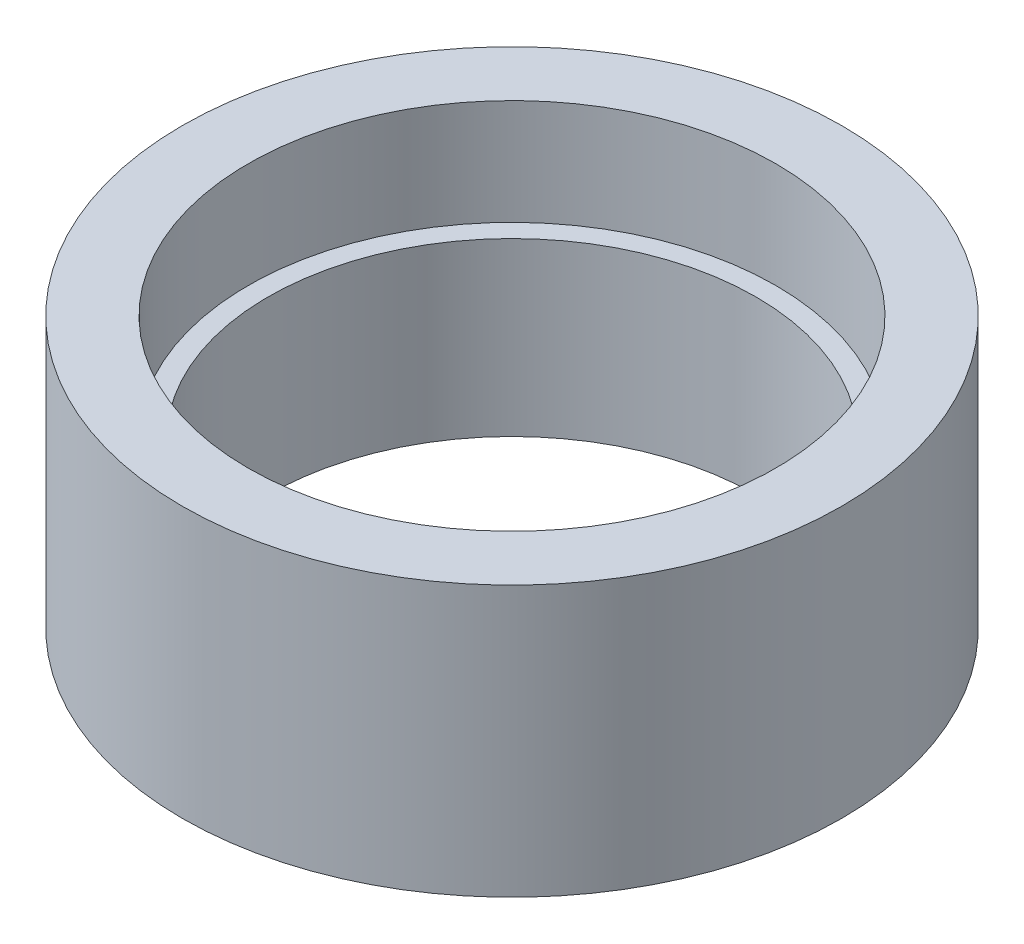
ISO-10303-21;
HEADER;
FILE_DESCRIPTION(('STEP AP214'),'2;1');
FILE_NAME('part.step','',(''),(''),'','','');
FILE_SCHEMA(('AUTOMOTIVE_DESIGN { 1 0 10303 214 1 1 1 1 }'));
ENDSEC;
DATA;
#1=APPLICATION_CONTEXT('core data for automotive mechanical design processes');
#2=APPLICATION_PROTOCOL_DEFINITION('international standard','automotive_design',2000,#1);
#3=PRODUCT_CONTEXT('',#1,'mechanical');
#4=PRODUCT('Part','Part','',(#3));
#5=PRODUCT_RELATED_PRODUCT_CATEGORY('part','',(#4));
#6=PRODUCT_DEFINITION_FORMATION('','',#4);
#7=PRODUCT_DEFINITION_CONTEXT('part definition',#1,'design');
#8=PRODUCT_DEFINITION('design','',#6,#7);
#9=PRODUCT_DEFINITION_SHAPE('','',#8);
#10=(LENGTH_UNIT() NAMED_UNIT(*) SI_UNIT(.MILLI.,.METRE.));
#11=(NAMED_UNIT(*) PLANE_ANGLE_UNIT() SI_UNIT($,.RADIAN.));
#12=(NAMED_UNIT(*) SI_UNIT($,.STERADIAN.) SOLID_ANGLE_UNIT());
#13=UNCERTAINTY_MEASURE_WITH_UNIT(LENGTH_MEASURE(1.E-05),#10,'distance_accuracy_value','');
#14=(GEOMETRIC_REPRESENTATION_CONTEXT(3) GLOBAL_UNCERTAINTY_ASSIGNED_CONTEXT((#13)) GLOBAL_UNIT_ASSIGNED_CONTEXT((#10,
#11,#12)) REPRESENTATION_CONTEXT('',''));
#15=CARTESIAN_POINT('',(0.,0.,0.));
#16=DIRECTION('',(0.,0.,1.));
#17=DIRECTION('',(1.,0.,0.));
#18=AXIS2_PLACEMENT_3D('',#15,#16,#17);
#19=CARTESIAN_POINT('',(0.,0.,0.));
#20=DIRECTION('',(0.,-1.,0.));
#21=DIRECTION('',(0.,0.,-1.));
#22=AXIS2_PLACEMENT_3D('',#19,#20,#21);
#23=CYLINDRICAL_SURFACE('',#22,37.);
#24=CARTESIAN_POINT('',(0.,0.,0.));
#25=DIRECTION('',(0.,-1.,0.));
#26=DIRECTION('',(0.,0.,-1.));
#27=AXIS2_PLACEMENT_3D('',#24,#25,#26);
#28=CIRCLE('',#27,37.);
#29=CARTESIAN_POINT('',(0.,0.,-37.));
#30=VERTEX_POINT('',#29);
#31=EDGE_CURVE('E41',#30,#30,#28,.F.);
#32=ORIENTED_EDGE('',*,*,#31,.F.);
#33=EDGE_LOOP('',(#32));
#34=FACE_BOUND('',#33,.T.);
#35=CARTESIAN_POINT('',(0.,26.,0.));
#36=DIRECTION('',(0.,-1.,0.));
#37=DIRECTION('',(0.,0.,-1.));
#38=AXIS2_PLACEMENT_3D('',#35,#36,#37);
#39=CIRCLE('',#38,37.);
#40=CARTESIAN_POINT('',(0.,26.,-37.));
#41=VERTEX_POINT('',#40);
#42=EDGE_CURVE('E19',#41,#41,#39,.T.);
#43=ORIENTED_EDGE('',*,*,#42,.F.);
#44=EDGE_LOOP('',(#43));
#45=FACE_BOUND('',#44,.T.);
#46=ADVANCED_FACE('F16',(#34,#45),#23,.F.);
#47=CARTESIAN_POINT('',(37.,26.,0.));
#48=DIRECTION('',(0.,1.,0.));
#49=DIRECTION('',(0.,0.,1.));
#50=AXIS2_PLACEMENT_3D('',#47,#48,#49);
#51=PLANE('',#50);
#52=CARTESIAN_POINT('',(0.,26.,0.));
#53=DIRECTION('',(0.,-1.,0.));
#54=DIRECTION('',(0.,0.,-1.));
#55=AXIS2_PLACEMENT_3D('',#52,#53,#54);
#56=CIRCLE('',#55,40.);
#57=CARTESIAN_POINT('',(0.,26.,-40.));
#58=VERTEX_POINT('',#57);
#59=EDGE_CURVE('E39',#58,#58,#56,.F.);
#60=ORIENTED_EDGE('',*,*,#59,.T.);
#61=EDGE_LOOP('',(#60));
#62=FACE_BOUND('',#61,.T.);
#63=ORIENTED_EDGE('',*,*,#42,.T.);
#64=EDGE_LOOP('',(#63));
#65=FACE_BOUND('',#64,.T.);
#66=ADVANCED_FACE('F48',(#62,#65),#51,.T.);
#67=CARTESIAN_POINT('',(40.,0.,0.));
#68=DIRECTION('',(0.,-1.,0.));
#69=DIRECTION('',(0.,0.,-1.));
#70=AXIS2_PLACEMENT_3D('',#67,#68,#69);
#71=PLANE('',#70);
#72=ORIENTED_EDGE('',*,*,#31,.T.);
#73=EDGE_LOOP('',(#72));
#74=FACE_BOUND('',#73,.T.);
#75=CARTESIAN_POINT('',(0.,0.,0.));
#76=DIRECTION('',(0.,-1.,0.));
#77=DIRECTION('',(0.,0.,-1.));
#78=AXIS2_PLACEMENT_3D('',#75,#76,#77);
#79=CIRCLE('',#78,40.);
#80=CARTESIAN_POINT('',(0.,0.,-40.));
#81=VERTEX_POINT('',#80);
#82=EDGE_CURVE('E36',#81,#81,#79,.F.);
#83=ORIENTED_EDGE('',*,*,#82,.F.);
#84=EDGE_LOOP('',(#83));
#85=FACE_BOUND('',#84,.T.);
#86=ADVANCED_FACE('F55',(#74,#85),#71,.T.);
#87=CARTESIAN_POINT('',(0.,0.,0.));
#88=DIRECTION('',(0.,-1.,0.));
#89=DIRECTION('',(0.,0.,-1.));
#90=AXIS2_PLACEMENT_3D('',#87,#88,#89);
#91=CYLINDRICAL_SURFACE('',#90,40.);
#92=ORIENTED_EDGE('',*,*,#59,.F.);
#93=EDGE_LOOP('',(#92));
#94=FACE_BOUND('',#93,.T.);
#95=CARTESIAN_POINT('',(0.,42.,0.));
#96=DIRECTION('',(0.,-1.,0.));
#97=DIRECTION('',(0.,0.,-1.));
#98=AXIS2_PLACEMENT_3D('',#95,#96,#97);
#99=CIRCLE('',#98,40.);
#100=CARTESIAN_POINT('',(0.,42.,-40.));
#101=VERTEX_POINT('',#100);
#102=EDGE_CURVE('E33',#101,#101,#99,.T.);
#103=ORIENTED_EDGE('',*,*,#102,.F.);
#104=EDGE_LOOP('',(#103));
#105=FACE_BOUND('',#104,.T.);
#106=ADVANCED_FACE('F75',(#94,#105),#91,.F.);
#107=CARTESIAN_POINT('',(0.,0.,0.));
#108=DIRECTION('',(0.,-1.,0.));
#109=DIRECTION('',(0.,0.,-1.));
#110=AXIS2_PLACEMENT_3D('',#107,#108,#109);
#111=CYLINDRICAL_SURFACE('',#110,40.);
#112=CARTESIAN_POINT('',(0.,0.999999999999999,0.));
#113=DIRECTION('',(0.,-1.,0.));
#114=DIRECTION('',(0.,0.,-1.));
#115=AXIS2_PLACEMENT_3D('',#112,#113,#114);
#116=CIRCLE('',#115,40.);
#117=CARTESIAN_POINT('',(0.,0.999999999999999,-40.));
#118=VERTEX_POINT('',#117);
#119=EDGE_CURVE('E28',#118,#118,#116,.F.);
#120=ORIENTED_EDGE('',*,*,#119,.F.);
#121=EDGE_LOOP('',(#120));
#122=FACE_BOUND('',#121,.T.);
#123=ORIENTED_EDGE('',*,*,#82,.T.);
#124=EDGE_LOOP('',(#123));
#125=FACE_BOUND('',#124,.T.);
#126=ADVANCED_FACE('F71',(#122,#125),#111,.T.);
#127=CARTESIAN_POINT('',(40.,42.,0.));
#128=DIRECTION('',(0.,1.,0.));
#129=DIRECTION('',(0.,0.,1.));
#130=AXIS2_PLACEMENT_3D('',#127,#128,#129);
#131=PLANE('',#130);
#132=CARTESIAN_POINT('',(0.,42.,0.));
#133=DIRECTION('',(0.,-1.,0.));
#134=DIRECTION('',(0.,0.,-1.));
#135=AXIS2_PLACEMENT_3D('',#132,#133,#134);
#136=CIRCLE('',#135,50.);
#137=CARTESIAN_POINT('',(0.,42.,-50.));
#138=VERTEX_POINT('',#137);
#139=EDGE_CURVE('E23',#138,#138,#136,.T.);
#140=ORIENTED_EDGE('',*,*,#139,.F.);
#141=EDGE_LOOP('',(#140));
#142=FACE_BOUND('',#141,.T.);
#143=ORIENTED_EDGE('',*,*,#102,.T.);
#144=EDGE_LOOP('',(#143));
#145=FACE_BOUND('',#144,.T.);
#146=ADVANCED_FACE('F64',(#142,#145),#131,.T.);
#147=CARTESIAN_POINT('',(40.,0.999999999999999,0.));
#148=DIRECTION('',(0.,-1.,0.));
#149=DIRECTION('',(0.,0.,-1.));
#150=AXIS2_PLACEMENT_3D('',#147,#148,#149);
#151=PLANE('',#150);
#152=ORIENTED_EDGE('',*,*,#119,.T.);
#153=EDGE_LOOP('',(#152));
#154=FACE_BOUND('',#153,.T.);
#155=CARTESIAN_POINT('',(0.,0.999999999999999,0.));
#156=DIRECTION('',(0.,-1.,0.));
#157=DIRECTION('',(0.,0.,-1.));
#158=AXIS2_PLACEMENT_3D('',#155,#156,#157);
#159=CIRCLE('',#158,50.);
#160=CARTESIAN_POINT('',(0.,0.999999999999999,-50.));
#161=VERTEX_POINT('',#160);
#162=EDGE_CURVE('E10',#161,#161,#159,.F.);
#163=ORIENTED_EDGE('',*,*,#162,.F.);
#164=EDGE_LOOP('',(#163));
#165=FACE_BOUND('',#164,.T.);
#166=ADVANCED_FACE('F59',(#154,#165),#151,.T.);
#167=CARTESIAN_POINT('',(0.,0.,0.));
#168=DIRECTION('',(0.,-1.,0.));
#169=DIRECTION('',(0.,0.,-1.));
#170=AXIS2_PLACEMENT_3D('',#167,#168,#169);
#171=CYLINDRICAL_SURFACE('',#170,50.);
#172=ORIENTED_EDGE('',*,*,#162,.T.);
#173=EDGE_LOOP('',(#172));
#174=FACE_BOUND('',#173,.T.);
#175=ORIENTED_EDGE('',*,*,#139,.T.);
#176=EDGE_LOOP('',(#175));
#177=FACE_BOUND('',#176,.T.);
#178=ADVANCED_FACE('F57',(#174,#177),#171,.T.);
#179=CLOSED_SHELL('',(#46,#66,#86,#106,#126,#146,#166,#178));
#180=MANIFOLD_SOLID_BREP('B1',#179);
#181=ADVANCED_BREP_SHAPE_REPRESENTATION('',(#18,#180),#14);
#182=SHAPE_DEFINITION_REPRESENTATION(#9,#181);
ENDSEC;
END-ISO-10303-21;
